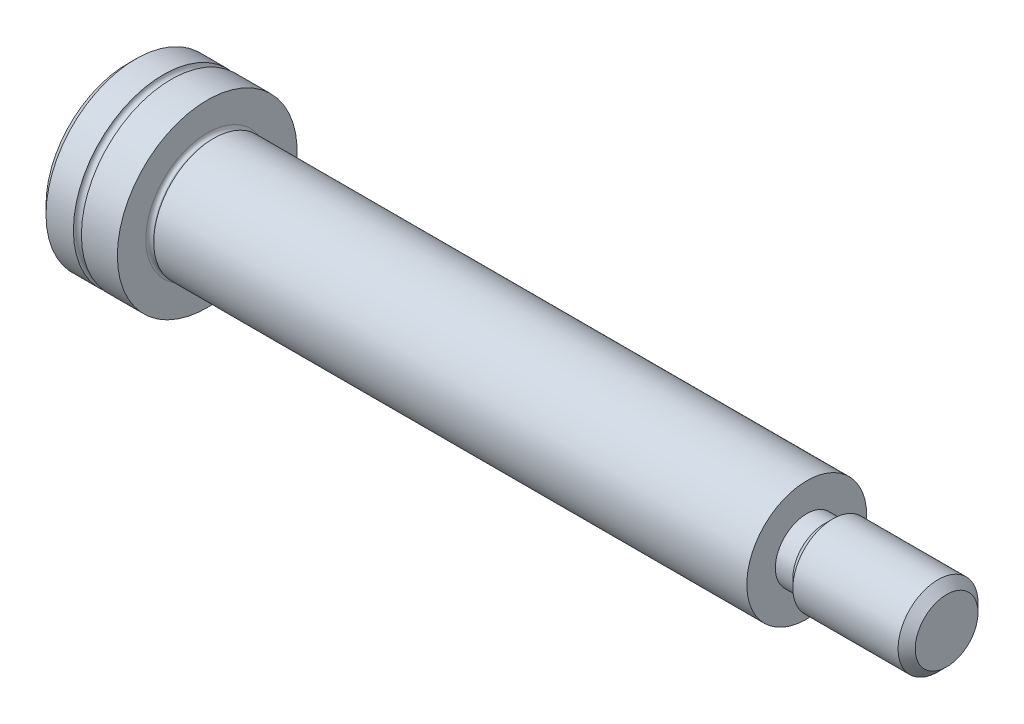
ISO-10303-21;
HEADER;
FILE_DESCRIPTION(('STEP AP214'),'2;1');
FILE_NAME('part.step','',(''),(''),'','','');
FILE_SCHEMA(('AUTOMOTIVE_DESIGN { 1 0 10303 214 1 1 1 1 }'));
ENDSEC;
DATA;
#1=APPLICATION_CONTEXT('core data for automotive mechanical design processes');
#2=APPLICATION_PROTOCOL_DEFINITION('international standard','automotive_design',2000,#1);
#3=PRODUCT_CONTEXT('',#1,'mechanical');
#4=PRODUCT('Part','Part','',(#3));
#5=PRODUCT_RELATED_PRODUCT_CATEGORY('part','',(#4));
#6=PRODUCT_DEFINITION_FORMATION('','',#4);
#7=PRODUCT_DEFINITION_CONTEXT('part definition',#1,'design');
#8=PRODUCT_DEFINITION('design','',#6,#7);
#9=PRODUCT_DEFINITION_SHAPE('','',#8);
#10=(LENGTH_UNIT() NAMED_UNIT(*) SI_UNIT(.MILLI.,.METRE.));
#11=(NAMED_UNIT(*) PLANE_ANGLE_UNIT() SI_UNIT($,.RADIAN.));
#12=(NAMED_UNIT(*) SI_UNIT($,.STERADIAN.) SOLID_ANGLE_UNIT());
#13=UNCERTAINTY_MEASURE_WITH_UNIT(LENGTH_MEASURE(1.E-05),#10,'distance_accuracy_value','');
#14=(GEOMETRIC_REPRESENTATION_CONTEXT(3) GLOBAL_UNCERTAINTY_ASSIGNED_CONTEXT((#13)) GLOBAL_UNIT_ASSIGNED_CONTEXT((#10,
#11,#12)) REPRESENTATION_CONTEXT('',''));
#15=CARTESIAN_POINT('',(0.,0.,0.));
#16=DIRECTION('',(0.,0.,1.));
#17=DIRECTION('',(1.,0.,0.));
#18=AXIS2_PLACEMENT_3D('',#15,#16,#17);
#19=CARTESIAN_POINT('',(0.,0.,0.));
#20=DIRECTION('',(-1.,0.,0.));
#21=DIRECTION('',(0.,0.,1.));
#22=AXIS2_PLACEMENT_3D('',#19,#20,#21);
#23=CYLINDRICAL_SURFACE('',#22,4.5);
#24=CARTESIAN_POINT('',(0.,0.,0.));
#25=DIRECTION('',(-1.,0.,0.));
#26=DIRECTION('',(0.,0.,1.));
#27=AXIS2_PLACEMENT_3D('',#24,#25,#26);
#28=CIRCLE('',#27,4.5);
#29=CARTESIAN_POINT('',(0.,0.,4.5));
#30=VERTEX_POINT('',#29);
#31=EDGE_CURVE('E160',#30,#30,#28,.T.);
#32=ORIENTED_EDGE('',*,*,#31,.T.);
#33=EDGE_LOOP('',(#32));
#34=FACE_BOUND('',#33,.T.);
#35=CARTESIAN_POINT('',(-1.8,0.,0.));
#36=DIRECTION('',(-1.,0.,0.));
#37=DIRECTION('',(0.,0.,1.));
#38=AXIS2_PLACEMENT_3D('',#35,#36,#37);
#39=CIRCLE('',#38,4.5);
#40=CARTESIAN_POINT('',(-1.8,0.,4.5));
#41=VERTEX_POINT('',#40);
#42=EDGE_CURVE('E166',#41,#41,#39,.T.);
#43=ORIENTED_EDGE('',*,*,#42,.F.);
#44=EDGE_LOOP('',(#43));
#45=FACE_BOUND('',#44,.T.);
#46=ADVANCED_FACE('F32',(#34,#45),#23,.T.);
#47=CARTESIAN_POINT('',(-2.,0.,0.));
#48=DIRECTION('',(-1.,0.,0.));
#49=DIRECTION('',(0.,0.,1.));
#50=AXIS2_PLACEMENT_3D('',#47,#48,#49);
#51=TOROIDAL_SURFACE('',#50,4.5,0.199999999999999);
#52=ORIENTED_EDGE('',*,*,#42,.T.);
#53=EDGE_LOOP('',(#52));
#54=FACE_BOUND('',#53,.T.);
#55=CARTESIAN_POINT('',(-2.2,0.,0.));
#56=DIRECTION('',(-1.,0.,0.));
#57=DIRECTION('',(0.,0.,1.));
#58=AXIS2_PLACEMENT_3D('',#55,#56,#57);
#59=CIRCLE('',#58,4.5);
#60=CARTESIAN_POINT('',(-2.2,0.,4.5));
#61=VERTEX_POINT('',#60);
#62=EDGE_CURVE('E163',#61,#61,#59,.T.);
#63=ORIENTED_EDGE('',*,*,#62,.F.);
#64=EDGE_LOOP('',(#63));
#65=FACE_BOUND('',#64,.T.);
#66=ADVANCED_FACE('F196',(#54,#65),#51,.F.);
#67=CARTESIAN_POINT('',(0.,0.,0.));
#68=DIRECTION('',(-1.,0.,0.));
#69=DIRECTION('',(0.,0.,1.));
#70=AXIS2_PLACEMENT_3D('',#67,#68,#69);
#71=CYLINDRICAL_SURFACE('',#70,4.5);
#72=CARTESIAN_POINT('',(-3.57050000004651,0.,0.));
#73=DIRECTION('',(-1.,0.,0.));
#74=DIRECTION('',(0.,0.,1.));
#75=AXIS2_PLACEMENT_3D('',#72,#73,#74);
#76=CIRCLE('',#75,4.5);
#77=CARTESIAN_POINT('',(-3.57050000004651,0.,4.5));
#78=VERTEX_POINT('',#77);
#79=EDGE_CURVE('E172',#78,#78,#76,.F.);
#80=ORIENTED_EDGE('',*,*,#79,.T.);
#81=EDGE_LOOP('',(#80));
#82=FACE_BOUND('',#81,.T.);
#83=ORIENTED_EDGE('',*,*,#62,.T.);
#84=EDGE_LOOP('',(#83));
#85=FACE_BOUND('',#84,.T.);
#86=ADVANCED_FACE('F202',(#82,#85),#71,.T.);
#87=CARTESIAN_POINT('',(-4.,0.,0.));
#88=DIRECTION('',(-1.,0.,0.));
#89=DIRECTION('',(0.,0.,1.));
#90=AXIS2_PLACEMENT_3D('',#87,#88,#89);
#91=PLANE('',#90);
#92=CARTESIAN_POINT('',(-4.,0.,0.));
#93=DIRECTION('',(-1.,0.,0.));
#94=DIRECTION('',(0.,0.,1.));
#95=AXIS2_PLACEMENT_3D('',#92,#93,#94);
#96=CIRCLE('',#95,4.07049999998968);
#97=CARTESIAN_POINT('',(-4.,0.,4.07049999998968));
#98=VERTEX_POINT('',#97);
#99=EDGE_CURVE('E169',#98,#98,#96,.T.);
#100=ORIENTED_EDGE('',*,*,#99,.T.);
#101=EDGE_LOOP('',(#100));
#102=FACE_BOUND('',#101,.T.);
#103=DIRECTION('',(0.,0.500000000000001,0.866025403784438));
#104=VECTOR('',#103,1.);
#105=CARTESIAN_POINT('',(-4.,-1.73205080756888,0.));
#106=LINE('',#105,#104);
#107=CARTESIAN_POINT('',(-4.,-1.73205080756888,0.));
#108=VERTEX_POINT('',#107);
#109=CARTESIAN_POINT('',(-4.,-0.866025403784439,1.5));
#110=VERTEX_POINT('',#109);
#111=EDGE_CURVE('E47',#108,#110,#106,.T.);
#112=ORIENTED_EDGE('',*,*,#111,.F.);
#113=DIRECTION('',(0.,-0.500000000000001,0.866025403784438));
#114=VECTOR('',#113,1.);
#115=CARTESIAN_POINT('',(-4.,-0.86602540378444,-1.5));
#116=LINE('',#115,#114);
#117=CARTESIAN_POINT('',(-4.,-0.86602540378444,-1.5));
#118=VERTEX_POINT('',#117);
#119=EDGE_CURVE('E133',#118,#108,#116,.T.);
#120=ORIENTED_EDGE('',*,*,#119,.F.);
#121=DIRECTION('',(0.,-1.,0.));
#122=VECTOR('',#121,1.);
#123=CARTESIAN_POINT('',(-4.,0.866025403784438,-1.5));
#124=LINE('',#123,#122);
#125=CARTESIAN_POINT('',(-4.,0.866025403784438,-1.5));
#126=VERTEX_POINT('',#125);
#127=EDGE_CURVE('E131',#126,#118,#124,.T.);
#128=ORIENTED_EDGE('',*,*,#127,.F.);
#129=DIRECTION('',(0.,-0.500000000000001,-0.866025403784438));
#130=VECTOR('',#129,1.);
#131=CARTESIAN_POINT('',(-4.,1.73205080756888,0.));
#132=LINE('',#131,#130);
#133=CARTESIAN_POINT('',(-4.,1.73205080756888,0.));
#134=VERTEX_POINT('',#133);
#135=EDGE_CURVE('E97',#134,#126,#132,.T.);
#136=ORIENTED_EDGE('',*,*,#135,.F.);
#137=DIRECTION('',(0.,0.5,-0.866025403784438));
#138=VECTOR('',#137,1.);
#139=CARTESIAN_POINT('',(-4.,0.86602540378444,1.5));
#140=LINE('',#139,#138);
#141=CARTESIAN_POINT('',(-4.,0.86602540378444,1.5));
#142=VERTEX_POINT('',#141);
#143=EDGE_CURVE('E127',#142,#134,#140,.T.);
#144=ORIENTED_EDGE('',*,*,#143,.F.);
#145=DIRECTION('',(0.,1.,0.));
#146=VECTOR('',#145,1.);
#147=CARTESIAN_POINT('',(-4.,-0.866025403784439,1.5));
#148=LINE('',#147,#146);
#149=EDGE_CURVE('E123',#110,#142,#148,.T.);
#150=ORIENTED_EDGE('',*,*,#149,.F.);
#151=EDGE_LOOP('',(#112,#120,#128,#136,#144,#150));
#152=FACE_BOUND('',#151,.T.);
#153=ADVANCED_FACE('F220',(#102,#152),#91,.T.);
#154=CARTESIAN_POINT('',(0.,4.5,0.));
#155=DIRECTION('',(1.,0.,0.));
#156=DIRECTION('',(0.,0.,-1.));
#157=AXIS2_PLACEMENT_3D('',#154,#155,#156);
#158=PLANE('',#157);
#159=CARTESIAN_POINT('',(0.,0.,0.));
#160=DIRECTION('',(1.,0.,0.));
#161=DIRECTION('',(0.,0.,-1.));
#162=AXIS2_PLACEMENT_3D('',#159,#160,#161);
#163=CIRCLE('',#162,3.075);
#164=CARTESIAN_POINT('',(0.,0.,-3.075));
#165=VERTEX_POINT('',#164);
#166=EDGE_CURVE('E11',#165,#165,#163,.F.);
#167=ORIENTED_EDGE('',*,*,#166,.T.);
#168=EDGE_LOOP('',(#167));
#169=FACE_BOUND('',#168,.T.);
#170=ORIENTED_EDGE('',*,*,#31,.F.);
#171=EDGE_LOOP('',(#170));
#172=FACE_BOUND('',#171,.T.);
#173=ADVANCED_FACE('F223',(#169,#172),#158,.T.);
#174=CARTESIAN_POINT('',(0.250717967674063,0.,0.));
#175=DIRECTION('',(-1.,0.,0.));
#176=DIRECTION('',(0.,0.,1.));
#177=AXIS2_PLACEMENT_3D('',#174,#175,#176);
#178=CYLINDRICAL_SURFACE('',#177,2.88);
#179=CARTESIAN_POINT('',(0.195,0.,0.));
#180=DIRECTION('',(1.,0.,0.));
#181=DIRECTION('',(0.,0.,-1.));
#182=AXIS2_PLACEMENT_3D('',#179,#180,#181);
#183=CIRCLE('',#182,2.88);
#184=CARTESIAN_POINT('',(0.195,0.,-2.88));
#185=VERTEX_POINT('',#184);
#186=EDGE_CURVE('E40',#185,#185,#183,.T.);
#187=ORIENTED_EDGE('',*,*,#186,.T.);
#188=EDGE_LOOP('',(#187));
#189=FACE_BOUND('',#188,.T.);
#190=CARTESIAN_POINT('',(0.250717967674063,0.,0.));
#191=DIRECTION('',(1.,0.,0.));
#192=DIRECTION('',(0.,0.,-1.));
#193=AXIS2_PLACEMENT_3D('',#190,#191,#192);
#194=CIRCLE('',#193,2.88);
#195=CARTESIAN_POINT('',(0.250717967674063,0.,-2.88));
#196=VERTEX_POINT('',#195);
#197=EDGE_CURVE('E157',#196,#196,#194,.T.);
#198=ORIENTED_EDGE('',*,*,#197,.F.);
#199=EDGE_LOOP('',(#198));
#200=FACE_BOUND('',#199,.T.);
#201=ADVANCED_FACE('F183',(#189,#200),#178,.T.);
#202=CARTESIAN_POINT('',(0.250717967674063,0.,0.));
#203=DIRECTION('',(1.,0.,0.));
#204=DIRECTION('',(0.,0.,-1.));
#205=AXIS2_PLACEMENT_3D('',#202,#203,#204);
#206=CONICAL_SURFACE('',#205,2.88000000000466,1.04719755105976);
#207=CARTESIAN_POINT('',(0.320000000000001,0.,0.));
#208=DIRECTION('',(1.,0.,0.));
#209=DIRECTION('',(0.,0.,-1.));
#210=AXIS2_PLACEMENT_3D('',#207,#208,#209);
#211=CIRCLE('',#210,3.00000000000689);
#212=CARTESIAN_POINT('',(0.320000000000001,0.,-3.00000000000689));
#213=VERTEX_POINT('',#212);
#214=EDGE_CURVE('E154',#213,#213,#211,.T.);
#215=ORIENTED_EDGE('',*,*,#214,.F.);
#216=EDGE_LOOP('',(#215));
#217=FACE_BOUND('',#216,.T.);
#218=ORIENTED_EDGE('',*,*,#197,.T.);
#219=EDGE_LOOP('',(#218));
#220=FACE_BOUND('',#219,.T.);
#221=ADVANCED_FACE('F281',(#217,#220),#206,.T.);
#222=CARTESIAN_POINT('',(30.,0.,0.));
#223=DIRECTION('',(-1.,0.,0.));
#224=DIRECTION('',(0.,0.,1.));
#225=AXIS2_PLACEMENT_3D('',#222,#223,#224);
#226=CYLINDRICAL_SURFACE('',#225,3.);
#227=CARTESIAN_POINT('',(30.,0.,0.));
#228=DIRECTION('',(1.,0.,0.));
#229=DIRECTION('',(0.,0.,-1.));
#230=AXIS2_PLACEMENT_3D('',#227,#228,#229);
#231=CIRCLE('',#230,3.);
#232=CARTESIAN_POINT('',(30.,0.,-3.));
#233=VERTEX_POINT('',#232);
#234=EDGE_CURVE('E149',#233,#233,#231,.T.);
#235=ORIENTED_EDGE('',*,*,#234,.F.);
#236=EDGE_LOOP('',(#235));
#237=FACE_BOUND('',#236,.T.);
#238=ORIENTED_EDGE('',*,*,#214,.T.);
#239=EDGE_LOOP('',(#238));
#240=FACE_BOUND('',#239,.T.);
#241=ADVANCED_FACE('F277',(#237,#240),#226,.T.);
#242=CARTESIAN_POINT('',(30.,0.,0.));
#243=DIRECTION('',(1.,0.,0.));
#244=DIRECTION('',(0.,0.,-1.));
#245=AXIS2_PLACEMENT_3D('',#242,#243,#244);
#246=PLANE('',#245);
#247=CARTESIAN_POINT('',(30.,0.,0.));
#248=DIRECTION('',(1.,0.,0.));
#249=DIRECTION('',(0.,0.,-1.));
#250=AXIS2_PLACEMENT_3D('',#247,#248,#249);
#251=CIRCLE('',#250,1.5705);
#252=CARTESIAN_POINT('',(30.,0.,-1.5705));
#253=VERTEX_POINT('',#252);
#254=EDGE_CURVE('E145',#253,#253,#251,.T.);
#255=ORIENTED_EDGE('',*,*,#254,.F.);
#256=EDGE_LOOP('',(#255));
#257=FACE_BOUND('',#256,.T.);
#258=ORIENTED_EDGE('',*,*,#234,.T.);
#259=EDGE_LOOP('',(#258));
#260=FACE_BOUND('',#259,.T.);
#261=ADVANCED_FACE('F273',(#257,#260),#246,.T.);
#262=CARTESIAN_POINT('',(30.875,0.,0.));
#263=DIRECTION('',(-1.,0.,0.));
#264=DIRECTION('',(0.,0.,1.));
#265=AXIS2_PLACEMENT_3D('',#262,#263,#264);
#266=CYLINDRICAL_SURFACE('',#265,1.5705);
#267=CARTESIAN_POINT('',(30.875,0.,0.));
#268=DIRECTION('',(1.,0.,0.));
#269=DIRECTION('',(0.,0.,-1.));
#270=AXIS2_PLACEMENT_3D('',#267,#268,#269);
#271=CIRCLE('',#270,1.5705);
#272=CARTESIAN_POINT('',(30.875,0.,-1.5705));
#273=VERTEX_POINT('',#272);
#274=EDGE_CURVE('E146',#273,#273,#271,.T.);
#275=ORIENTED_EDGE('',*,*,#274,.F.);
#276=EDGE_LOOP('',(#275));
#277=FACE_BOUND('',#276,.T.);
#278=ORIENTED_EDGE('',*,*,#254,.T.);
#279=EDGE_LOOP('',(#278));
#280=FACE_BOUND('',#279,.T.);
#281=ADVANCED_FACE('F269',(#277,#280),#266,.T.);
#282=CARTESIAN_POINT('',(30.875,0.,0.));
#283=DIRECTION('',(1.,0.,0.));
#284=DIRECTION('',(0.,0.,-1.));
#285=AXIS2_PLACEMENT_3D('',#282,#283,#284);
#286=CONICAL_SURFACE('',#285,1.57049999997662,0.785398163397452);
#287=CARTESIAN_POINT('',(31.3044999999761,0.,0.));
#288=DIRECTION('',(1.,0.,0.));
#289=DIRECTION('',(0.,0.,-1.));
#290=AXIS2_PLACEMENT_3D('',#287,#288,#289);
#291=CIRCLE('',#290,1.99999999995271);
#292=CARTESIAN_POINT('',(31.3044999999761,0.,-1.99999999995271));
#293=VERTEX_POINT('',#292);
#294=EDGE_CURVE('E137',#293,#293,#291,.T.);
#295=ORIENTED_EDGE('',*,*,#294,.F.);
#296=EDGE_LOOP('',(#295));
#297=FACE_BOUND('',#296,.T.);
#298=ORIENTED_EDGE('',*,*,#274,.T.);
#299=EDGE_LOOP('',(#298));
#300=FACE_BOUND('',#299,.T.);
#301=ADVANCED_FACE('F265',(#297,#300),#286,.T.);
#302=CARTESIAN_POINT('',(37.,0.,0.));
#303=DIRECTION('',(-1.,0.,0.));
#304=DIRECTION('',(0.,0.,1.));
#305=AXIS2_PLACEMENT_3D('',#302,#303,#304);
#306=CYLINDRICAL_SURFACE('',#305,2.);
#307=CARTESIAN_POINT('',(36.5705000000465,0.,0.));
#308=DIRECTION('',(1.,0.,0.));
#309=DIRECTION('',(0.,0.,-1.));
#310=AXIS2_PLACEMENT_3D('',#307,#308,#309);
#311=CIRCLE('',#310,2.);
#312=CARTESIAN_POINT('',(36.5705000000465,0.,-2.));
#313=VERTEX_POINT('',#312);
#314=EDGE_CURVE('E178',#313,#313,#311,.F.);
#315=ORIENTED_EDGE('',*,*,#314,.T.);
#316=EDGE_LOOP('',(#315));
#317=FACE_BOUND('',#316,.T.);
#318=ORIENTED_EDGE('',*,*,#294,.T.);
#319=EDGE_LOOP('',(#318));
#320=FACE_BOUND('',#319,.T.);
#321=ADVANCED_FACE('F261',(#317,#320),#306,.T.);
#322=CARTESIAN_POINT('',(37.,0.,0.));
#323=DIRECTION('',(1.,0.,0.));
#324=DIRECTION('',(0.,0.,-1.));
#325=AXIS2_PLACEMENT_3D('',#322,#323,#324);
#326=PLANE('',#325);
#327=CARTESIAN_POINT('',(37.,0.,0.));
#328=DIRECTION('',(1.,0.,0.));
#329=DIRECTION('',(0.,0.,-1.));
#330=AXIS2_PLACEMENT_3D('',#327,#328,#329);
#331=CIRCLE('',#330,1.57049999998969);
#332=CARTESIAN_POINT('',(37.,0.,-1.57049999998969));
#333=VERTEX_POINT('',#332);
#334=EDGE_CURVE('E175',#333,#333,#331,.T.);
#335=ORIENTED_EDGE('',*,*,#334,.T.);
#336=EDGE_LOOP('',(#335));
#337=FACE_BOUND('',#336,.T.);
#338=ADVANCED_FACE('F258',(#337),#326,.T.);
#339=CARTESIAN_POINT('',(-2.,-1.73205080756888,0.));
#340=DIRECTION('',(0.,-0.866025403784438,0.500000000000001));
#341=DIRECTION('',(0.,-0.500000000000001,-0.866025403784438));
#342=AXIS2_PLACEMENT_3D('',#339,#340,#341);
#343=PLANE('',#342);
#344=ORIENTED_EDGE('',*,*,#111,.T.);
#345=DIRECTION('',(-1.,0.,0.));
#346=VECTOR('',#345,1.);
#347=CARTESIAN_POINT('',(-2.,-0.866025403784439,1.5));
#348=LINE('',#347,#346);
#349=CARTESIAN_POINT('',(-2.,-0.866025403784439,1.5));
#350=VERTEX_POINT('',#349);
#351=EDGE_CURVE('E78',#350,#110,#348,.T.);
#352=ORIENTED_EDGE('',*,*,#351,.F.);
#353=DIRECTION('',(0.,0.500000000000001,0.866025403784438));
#354=VECTOR('',#353,1.);
#355=CARTESIAN_POINT('',(-2.,-1.73205080756888,0.));
#356=LINE('',#355,#354);
#357=CARTESIAN_POINT('',(-2.,-1.73205080756888,0.));
#358=VERTEX_POINT('',#357);
#359=EDGE_CURVE('E135',#358,#350,#356,.T.);
#360=ORIENTED_EDGE('',*,*,#359,.F.);
#361=DIRECTION('',(-1.,0.,0.));
#362=VECTOR('',#361,1.);
#363=CARTESIAN_POINT('',(-2.,-1.73205080756888,0.));
#364=LINE('',#363,#362);
#365=EDGE_CURVE('E55',#358,#108,#364,.T.);
#366=ORIENTED_EDGE('',*,*,#365,.T.);
#367=EDGE_LOOP('',(#344,#352,#360,#366));
#368=FACE_BOUND('',#367,.T.);
#369=ADVANCED_FACE('F248',(#368),#343,.F.);
#370=CARTESIAN_POINT('',(-2.,-0.86602540378444,-1.5));
#371=DIRECTION('',(0.,-0.866025403784438,-0.500000000000001));
#372=DIRECTION('',(0.,0.500000000000001,-0.866025403784438));
#373=AXIS2_PLACEMENT_3D('',#370,#371,#372);
#374=PLANE('',#373);
#375=ORIENTED_EDGE('',*,*,#119,.T.);
#376=ORIENTED_EDGE('',*,*,#365,.F.);
#377=DIRECTION('',(0.,-0.500000000000001,0.866025403784438));
#378=VECTOR('',#377,1.);
#379=CARTESIAN_POINT('',(-2.,-0.86602540378444,-1.5));
#380=LINE('',#379,#378);
#381=CARTESIAN_POINT('',(-2.,-0.86602540378444,-1.5));
#382=VERTEX_POINT('',#381);
#383=EDGE_CURVE('E109',#382,#358,#380,.T.);
#384=ORIENTED_EDGE('',*,*,#383,.F.);
#385=DIRECTION('',(-1.,0.,0.));
#386=VECTOR('',#385,1.);
#387=CARTESIAN_POINT('',(-2.,-0.86602540378444,-1.5));
#388=LINE('',#387,#386);
#389=EDGE_CURVE('E101',#382,#118,#388,.T.);
#390=ORIENTED_EDGE('',*,*,#389,.T.);
#391=EDGE_LOOP('',(#375,#376,#384,#390));
#392=FACE_BOUND('',#391,.T.);
#393=ADVANCED_FACE('F245',(#392),#374,.F.);
#394=CARTESIAN_POINT('',(-2.,0.866025403784438,-1.5));
#395=DIRECTION('',(0.,0.,-1.));
#396=DIRECTION('',(0.,1.,0.));
#397=AXIS2_PLACEMENT_3D('',#394,#395,#396);
#398=PLANE('',#397);
#399=ORIENTED_EDGE('',*,*,#127,.T.);
#400=ORIENTED_EDGE('',*,*,#389,.F.);
#401=DIRECTION('',(0.,-1.,0.));
#402=VECTOR('',#401,1.);
#403=CARTESIAN_POINT('',(-2.,0.866025403784438,-1.5));
#404=LINE('',#403,#402);
#405=CARTESIAN_POINT('',(-2.,0.866025403784438,-1.5));
#406=VERTEX_POINT('',#405);
#407=EDGE_CURVE('E105',#406,#382,#404,.T.);
#408=ORIENTED_EDGE('',*,*,#407,.F.);
#409=DIRECTION('',(-1.,0.,0.));
#410=VECTOR('',#409,1.);
#411=CARTESIAN_POINT('',(-2.,0.866025403784438,-1.5));
#412=LINE('',#411,#410);
#413=EDGE_CURVE('E90',#406,#126,#412,.T.);
#414=ORIENTED_EDGE('',*,*,#413,.T.);
#415=EDGE_LOOP('',(#399,#400,#408,#414));
#416=FACE_BOUND('',#415,.T.);
#417=ADVANCED_FACE('F106',(#416),#398,.F.);
#418=CARTESIAN_POINT('',(-2.,1.73205080756888,0.));
#419=DIRECTION('',(0.,0.866025403784438,-0.500000000000001));
#420=DIRECTION('',(0.,0.500000000000001,0.866025403784438));
#421=AXIS2_PLACEMENT_3D('',#418,#419,#420);
#422=PLANE('',#421);
#423=ORIENTED_EDGE('',*,*,#135,.T.);
#424=ORIENTED_EDGE('',*,*,#413,.F.);
#425=DIRECTION('',(0.,-0.500000000000001,-0.866025403784438));
#426=VECTOR('',#425,1.);
#427=CARTESIAN_POINT('',(-2.,1.73205080756888,0.));
#428=LINE('',#427,#426);
#429=CARTESIAN_POINT('',(-2.,1.73205080756888,0.));
#430=VERTEX_POINT('',#429);
#431=EDGE_CURVE('E94',#430,#406,#428,.T.);
#432=ORIENTED_EDGE('',*,*,#431,.F.);
#433=DIRECTION('',(-1.,0.,0.));
#434=VECTOR('',#433,1.);
#435=CARTESIAN_POINT('',(-2.,1.73205080756888,0.));
#436=LINE('',#435,#434);
#437=EDGE_CURVE('E102',#430,#134,#436,.T.);
#438=ORIENTED_EDGE('',*,*,#437,.T.);
#439=EDGE_LOOP('',(#423,#424,#432,#438));
#440=FACE_BOUND('',#439,.T.);
#441=ADVANCED_FACE('F92',(#440),#422,.F.);
#442=CARTESIAN_POINT('',(-2.,0.86602540378444,1.5));
#443=DIRECTION('',(0.,0.866025403784438,0.5));
#444=DIRECTION('',(0.,-0.5,0.866025403784439));
#445=AXIS2_PLACEMENT_3D('',#442,#443,#444);
#446=PLANE('',#445);
#447=ORIENTED_EDGE('',*,*,#143,.T.);
#448=ORIENTED_EDGE('',*,*,#437,.F.);
#449=DIRECTION('',(0.,0.5,-0.866025403784438));
#450=VECTOR('',#449,1.);
#451=CARTESIAN_POINT('',(-2.,0.86602540378444,1.5));
#452=LINE('',#451,#450);
#453=CARTESIAN_POINT('',(-2.,0.86602540378444,1.5));
#454=VERTEX_POINT('',#453);
#455=EDGE_CURVE('E115',#454,#430,#452,.T.);
#456=ORIENTED_EDGE('',*,*,#455,.F.);
#457=DIRECTION('',(-1.,0.,0.));
#458=VECTOR('',#457,1.);
#459=CARTESIAN_POINT('',(-2.,0.86602540378444,1.5));
#460=LINE('',#459,#458);
#461=EDGE_CURVE('E140',#454,#142,#460,.T.);
#462=ORIENTED_EDGE('',*,*,#461,.T.);
#463=EDGE_LOOP('',(#447,#448,#456,#462));
#464=FACE_BOUND('',#463,.T.);
#465=ADVANCED_FACE('F242',(#464),#446,.F.);
#466=CARTESIAN_POINT('',(-2.,-0.866025403784439,1.5));
#467=DIRECTION('',(0.,0.,1.));
#468=DIRECTION('',(0.,-1.,0.));
#469=AXIS2_PLACEMENT_3D('',#466,#467,#468);
#470=PLANE('',#469);
#471=ORIENTED_EDGE('',*,*,#149,.T.);
#472=ORIENTED_EDGE('',*,*,#461,.F.);
#473=DIRECTION('',(0.,1.,0.));
#474=VECTOR('',#473,1.);
#475=CARTESIAN_POINT('',(-2.,-0.866025403784439,1.5));
#476=LINE('',#475,#474);
#477=EDGE_CURVE('E117',#350,#454,#476,.T.);
#478=ORIENTED_EDGE('',*,*,#477,.F.);
#479=ORIENTED_EDGE('',*,*,#351,.T.);
#480=EDGE_LOOP('',(#471,#472,#478,#479));
#481=FACE_BOUND('',#480,.T.);
#482=ADVANCED_FACE('F229',(#481),#470,.F.);
#483=CARTESIAN_POINT('',(-2.,0.,0.));
#484=DIRECTION('',(-1.,0.,0.));
#485=DIRECTION('',(0.,0.,1.));
#486=AXIS2_PLACEMENT_3D('',#483,#484,#485);
#487=PLANE('',#486);
#488=CARTESIAN_POINT('',(-2.0000000000031,0.,0.));
#489=DIRECTION('',(1.,0.,0.));
#490=DIRECTION('',(0.,1.,0.));
#491=AXIS2_PLACEMENT_3D('',#488,#489,#490);
#492=CIRCLE('',#491,1.43999999999819);
#493=CARTESIAN_POINT('',(-2.0000000000031,1.43999999999819,0.));
#494=VERTEX_POINT('',#493);
#495=EDGE_CURVE('E124',#494,#494,#492,.T.);
#496=ORIENTED_EDGE('',*,*,#495,.T.);
#497=EDGE_LOOP('',(#496));
#498=FACE_BOUND('',#497,.T.);
#499=ORIENTED_EDGE('',*,*,#359,.T.);
#500=ORIENTED_EDGE('',*,*,#477,.T.);
#501=ORIENTED_EDGE('',*,*,#455,.T.);
#502=ORIENTED_EDGE('',*,*,#431,.T.);
#503=ORIENTED_EDGE('',*,*,#407,.T.);
#504=ORIENTED_EDGE('',*,*,#383,.T.);
#505=EDGE_LOOP('',(#499,#500,#501,#502,#503,#504));
#506=FACE_BOUND('',#505,.T.);
#507=ADVANCED_FACE('F112',(#498,#506),#487,.T.);
#508=CARTESIAN_POINT('',(-1.16861561237108,0.,0.));
#509=DIRECTION('',(-1.,0.,0.));
#510=DIRECTION('',(0.,-1.,0.));
#511=AXIS2_PLACEMENT_3D('',#508,#509,#510);
#512=CONICAL_SURFACE('',#511,0.,1.0471975511966);
#513=ORIENTED_EDGE('',*,*,#495,.F.);
#514=EDGE_LOOP('',(#513));
#515=FACE_BOUND('',#514,.T.);
#516=CARTESIAN_POINT('',(-1.16861561237108,0.,0.));
#517=VERTEX_POINT('',#516);
#518=VERTEX_LOOP('',#517);
#519=FACE_BOUND('',#518,.T.);
#520=ADVANCED_FACE('F209',(#515,#519),#512,.F.);
#521=CARTESIAN_POINT('',(-4.,0.,0.));
#522=DIRECTION('',(1.,0.,0.));
#523=DIRECTION('',(0.,0.,-1.));
#524=AXIS2_PLACEMENT_3D('',#521,#522,#523);
#525=CONICAL_SURFACE('',#524,4.07049999998968,0.785398163463613);
#526=ORIENTED_EDGE('',*,*,#79,.F.);
#527=EDGE_LOOP('',(#526));
#528=FACE_BOUND('',#527,.T.);
#529=ORIENTED_EDGE('',*,*,#99,.F.);
#530=EDGE_LOOP('',(#529));
#531=FACE_BOUND('',#530,.T.);
#532=ADVANCED_FACE('F192',(#528,#531),#525,.T.);
#533=CARTESIAN_POINT('',(37.,0.,0.));
#534=DIRECTION('',(-1.,0.,0.));
#535=DIRECTION('',(0.,0.,1.));
#536=AXIS2_PLACEMENT_3D('',#533,#534,#535);
#537=CONICAL_SURFACE('',#536,1.57049999998969,0.785398163463608);
#538=ORIENTED_EDGE('',*,*,#314,.F.);
#539=EDGE_LOOP('',(#538));
#540=FACE_BOUND('',#539,.T.);
#541=ORIENTED_EDGE('',*,*,#334,.F.);
#542=EDGE_LOOP('',(#541));
#543=FACE_BOUND('',#542,.T.);
#544=ADVANCED_FACE('F187',(#540,#543),#537,.T.);
#545=CARTESIAN_POINT('',(0.195,0.,0.));
#546=DIRECTION('',(1.,0.,0.));
#547=DIRECTION('',(0.,0.,-1.));
#548=AXIS2_PLACEMENT_3D('',#545,#546,#547);
#549=TOROIDAL_SURFACE('',#548,3.075,0.195);
#550=ORIENTED_EDGE('',*,*,#166,.F.);
#551=EDGE_LOOP('',(#550));
#552=FACE_BOUND('',#551,.T.);
#553=ORIENTED_EDGE('',*,*,#186,.F.);
#554=EDGE_LOOP('',(#553));
#555=FACE_BOUND('',#554,.T.);
#556=ADVANCED_FACE('F34',(#552,#555),#549,.F.);
#557=CLOSED_SHELL('',(#46,#66,#86,#153,#173,#201,#221,#241,#261,#281,#301,#321,#338,#369,#393,
#417,#441,#465,#482,#507,#520,#532,#544,#556));
#558=MANIFOLD_SOLID_BREP('B2',#557);
#559=ADVANCED_BREP_SHAPE_REPRESENTATION('',(#18,#558),#14);
#560=SHAPE_DEFINITION_REPRESENTATION(#9,#559);
ENDSEC;
END-ISO-10303-21;
